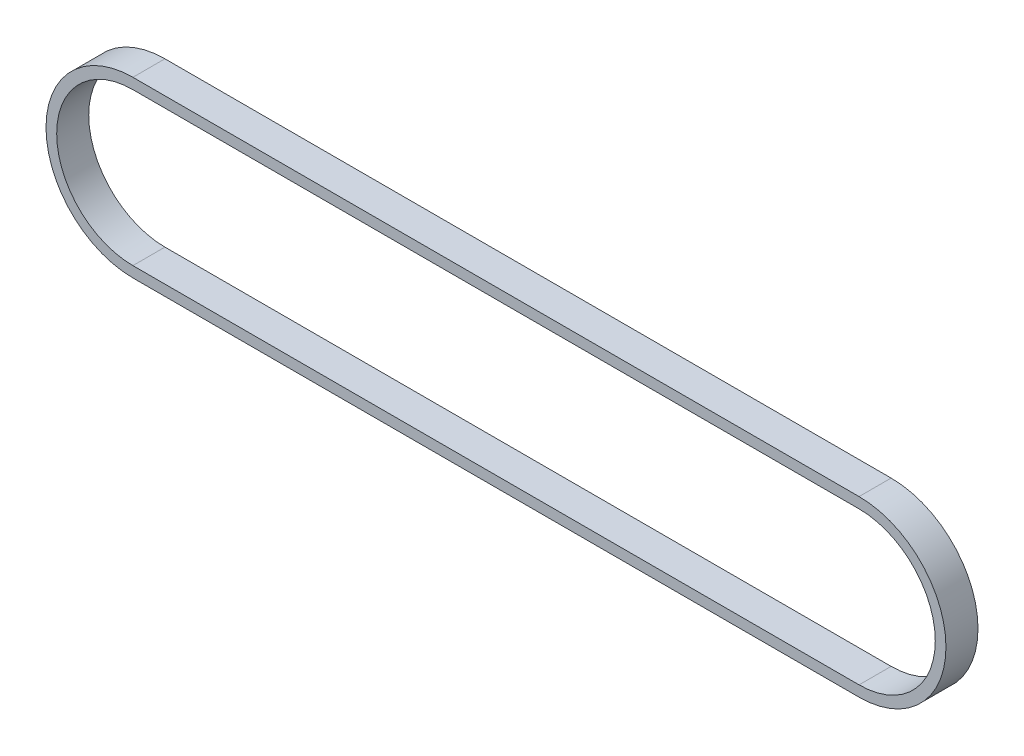
ISO-10303-21;
HEADER;
FILE_DESCRIPTION(('STEP AP214'),'2;1');
FILE_NAME('part.step','',(''),(''),'','','');
FILE_SCHEMA(('AUTOMOTIVE_DESIGN { 1 0 10303 214 1 1 1 1 }'));
ENDSEC;
DATA;
#1=APPLICATION_CONTEXT('core data for automotive mechanical design processes');
#2=APPLICATION_PROTOCOL_DEFINITION('international standard','automotive_design',2000,#1);
#3=PRODUCT_CONTEXT('',#1,'mechanical');
#4=PRODUCT('Part','Part','',(#3));
#5=PRODUCT_RELATED_PRODUCT_CATEGORY('part','',(#4));
#6=PRODUCT_DEFINITION_FORMATION('','',#4);
#7=PRODUCT_DEFINITION_CONTEXT('part definition',#1,'design');
#8=PRODUCT_DEFINITION('design','',#6,#7);
#9=PRODUCT_DEFINITION_SHAPE('','',#8);
#10=(LENGTH_UNIT() NAMED_UNIT(*) SI_UNIT(.MILLI.,.METRE.));
#11=(NAMED_UNIT(*) PLANE_ANGLE_UNIT() SI_UNIT($,.RADIAN.));
#12=(NAMED_UNIT(*) SI_UNIT($,.STERADIAN.) SOLID_ANGLE_UNIT());
#13=UNCERTAINTY_MEASURE_WITH_UNIT(LENGTH_MEASURE(1.E-05),#10,'distance_accuracy_value','');
#14=(GEOMETRIC_REPRESENTATION_CONTEXT(3) GLOBAL_UNCERTAINTY_ASSIGNED_CONTEXT((#13)) GLOBAL_UNIT_ASSIGNED_CONTEXT((#10,
#11,#12)) REPRESENTATION_CONTEXT('',''));
#15=CARTESIAN_POINT('',(0.,0.,0.));
#16=DIRECTION('',(0.,0.,1.));
#17=DIRECTION('',(1.,0.,0.));
#18=AXIS2_PLACEMENT_3D('',#15,#16,#17);
#19=CARTESIAN_POINT('',(0.,0.,4.5));
#20=DIRECTION('',(0.,0.,-1.));
#21=DIRECTION('',(-1.,0.,0.));
#22=AXIS2_PLACEMENT_3D('',#19,#20,#21);
#23=CYLINDRICAL_SURFACE('',#22,21.4);
#24=CARTESIAN_POINT('',(0.,0.,-4.5));
#25=DIRECTION('',(0.,0.,1.));
#26=DIRECTION('',(1.,0.,0.));
#27=AXIS2_PLACEMENT_3D('',#24,#25,#26);
#28=CIRCLE('',#27,21.4);
#29=CARTESIAN_POINT('',(0.,21.4,-4.5));
#30=VERTEX_POINT('',#29);
#31=CARTESIAN_POINT('',(0.,-21.4,-4.5));
#32=VERTEX_POINT('',#31);
#33=EDGE_CURVE('E146',#30,#32,#28,.T.);
#34=ORIENTED_EDGE('',*,*,#33,.F.);
#35=DIRECTION('',(0.,0.,-1.));
#36=VECTOR('',#35,1.);
#37=CARTESIAN_POINT('',(0.,21.4,4.5));
#38=LINE('',#37,#36);
#39=CARTESIAN_POINT('',(0.,21.4,4.5));
#40=VERTEX_POINT('',#39);
#41=EDGE_CURVE('E11',#40,#30,#38,.T.);
#42=ORIENTED_EDGE('',*,*,#41,.F.);
#43=CARTESIAN_POINT('',(0.,0.,4.5));
#44=DIRECTION('',(0.,0.,1.));
#45=DIRECTION('',(1.,0.,0.));
#46=AXIS2_PLACEMENT_3D('',#43,#44,#45);
#47=CIRCLE('',#46,21.4);
#48=CARTESIAN_POINT('',(0.,-21.4,4.5));
#49=VERTEX_POINT('',#48);
#50=EDGE_CURVE('E118',#40,#49,#47,.T.);
#51=ORIENTED_EDGE('',*,*,#50,.T.);
#52=DIRECTION('',(0.,0.,-1.));
#53=VECTOR('',#52,1.);
#54=CARTESIAN_POINT('',(0.,-21.4,4.5));
#55=LINE('',#54,#53);
#56=EDGE_CURVE('E57',#49,#32,#55,.T.);
#57=ORIENTED_EDGE('',*,*,#56,.T.);
#58=EDGE_LOOP('',(#34,#42,#51,#57));
#59=FACE_BOUND('',#58,.T.);
#60=ADVANCED_FACE('F38',(#59),#23,.F.);
#61=CARTESIAN_POINT('',(0.,21.4,4.5));
#62=DIRECTION('',(0.,1.,0.));
#63=DIRECTION('',(0.,0.,1.));
#64=AXIS2_PLACEMENT_3D('',#61,#62,#63);
#65=PLANE('',#64);
#66=DIRECTION('',(1.,0.,0.));
#67=VECTOR('',#66,1.);
#68=CARTESIAN_POINT('',(0.,21.4,-4.5));
#69=LINE('',#68,#67);
#70=CARTESIAN_POINT('',(203.94484,21.4,-4.5));
#71=VERTEX_POINT('',#70);
#72=EDGE_CURVE('E124',#30,#71,#69,.T.);
#73=ORIENTED_EDGE('',*,*,#72,.T.);
#74=DIRECTION('',(0.,0.,-1.));
#75=VECTOR('',#74,1.);
#76=CARTESIAN_POINT('',(203.94484,21.4,4.5));
#77=LINE('',#76,#75);
#78=CARTESIAN_POINT('',(203.94484,21.4,4.5));
#79=VERTEX_POINT('',#78);
#80=EDGE_CURVE('E48',#79,#71,#77,.T.);
#81=ORIENTED_EDGE('',*,*,#80,.F.);
#82=DIRECTION('',(1.,0.,0.));
#83=VECTOR('',#82,1.);
#84=CARTESIAN_POINT('',(0.,21.4,4.5));
#85=LINE('',#84,#83);
#86=EDGE_CURVE('E112',#40,#79,#85,.T.);
#87=ORIENTED_EDGE('',*,*,#86,.F.);
#88=ORIENTED_EDGE('',*,*,#41,.T.);
#89=EDGE_LOOP('',(#73,#81,#87,#88));
#90=FACE_BOUND('',#89,.T.);
#91=ADVANCED_FACE('F122',(#90),#65,.F.);
#92=CARTESIAN_POINT('',(203.94484,0.,4.5));
#93=DIRECTION('',(0.,0.,-1.));
#94=DIRECTION('',(-1.,0.,0.));
#95=AXIS2_PLACEMENT_3D('',#92,#93,#94);
#96=CYLINDRICAL_SURFACE('',#95,21.4);
#97=CARTESIAN_POINT('',(203.94484,0.,-4.5));
#98=DIRECTION('',(0.,0.,1.));
#99=DIRECTION('',(1.,0.,0.));
#100=AXIS2_PLACEMENT_3D('',#97,#98,#99);
#101=CIRCLE('',#100,21.4);
#102=CARTESIAN_POINT('',(203.94484,-21.4,-4.5));
#103=VERTEX_POINT('',#102);
#104=EDGE_CURVE('E149',#103,#71,#101,.T.);
#105=ORIENTED_EDGE('',*,*,#104,.F.);
#106=DIRECTION('',(0.,0.,-1.));
#107=VECTOR('',#106,1.);
#108=CARTESIAN_POINT('',(203.94484,-21.4,4.5));
#109=LINE('',#108,#107);
#110=CARTESIAN_POINT('',(203.94484,-21.4,4.5));
#111=VERTEX_POINT('',#110);
#112=EDGE_CURVE('E82',#111,#103,#109,.T.);
#113=ORIENTED_EDGE('',*,*,#112,.F.);
#114=CARTESIAN_POINT('',(203.94484,0.,4.5));
#115=DIRECTION('',(0.,0.,1.));
#116=DIRECTION('',(1.,0.,0.));
#117=AXIS2_PLACEMENT_3D('',#114,#115,#116);
#118=CIRCLE('',#117,21.4);
#119=EDGE_CURVE('E117',#111,#79,#118,.T.);
#120=ORIENTED_EDGE('',*,*,#119,.T.);
#121=ORIENTED_EDGE('',*,*,#80,.T.);
#122=EDGE_LOOP('',(#105,#113,#120,#121));
#123=FACE_BOUND('',#122,.T.);
#124=ADVANCED_FACE('F128',(#123),#96,.F.);
#125=CARTESIAN_POINT('',(0.,-24.4,4.5));
#126=DIRECTION('',(0.,1.,0.));
#127=DIRECTION('',(0.,0.,1.));
#128=AXIS2_PLACEMENT_3D('',#125,#126,#127);
#129=PLANE('',#128);
#130=DIRECTION('',(1.,0.,0.));
#131=VECTOR('',#130,1.);
#132=CARTESIAN_POINT('',(0.,-24.4,-4.5));
#133=LINE('',#132,#131);
#134=CARTESIAN_POINT('',(0.,-24.4,-4.5));
#135=VERTEX_POINT('',#134);
#136=CARTESIAN_POINT('',(203.94484,-24.4,-4.5));
#137=VERTEX_POINT('',#136);
#138=EDGE_CURVE('E135',#135,#137,#133,.T.);
#139=ORIENTED_EDGE('',*,*,#138,.T.);
#140=DIRECTION('',(0.,0.,-1.));
#141=VECTOR('',#140,1.);
#142=CARTESIAN_POINT('',(203.94484,-24.4,4.5));
#143=LINE('',#142,#141);
#144=CARTESIAN_POINT('',(203.94484,-24.4,4.5));
#145=VERTEX_POINT('',#144);
#146=EDGE_CURVE('E42',#145,#137,#143,.T.);
#147=ORIENTED_EDGE('',*,*,#146,.F.);
#148=DIRECTION('',(1.,0.,0.));
#149=VECTOR('',#148,1.);
#150=CARTESIAN_POINT('',(0.,-24.4,4.5));
#151=LINE('',#150,#149);
#152=CARTESIAN_POINT('',(0.,-24.4,4.5));
#153=VERTEX_POINT('',#152);
#154=EDGE_CURVE('E154',#153,#145,#151,.T.);
#155=ORIENTED_EDGE('',*,*,#154,.F.);
#156=DIRECTION('',(0.,0.,-1.));
#157=VECTOR('',#156,1.);
#158=CARTESIAN_POINT('',(0.,-24.4,4.5));
#159=LINE('',#158,#157);
#160=EDGE_CURVE('E131',#153,#135,#159,.T.);
#161=ORIENTED_EDGE('',*,*,#160,.T.);
#162=EDGE_LOOP('',(#139,#147,#155,#161));
#163=FACE_BOUND('',#162,.T.);
#164=ADVANCED_FACE('F40',(#163),#129,.F.);
#165=CARTESIAN_POINT('',(203.94484,0.,4.5));
#166=DIRECTION('',(0.,0.,-1.));
#167=DIRECTION('',(-1.,0.,0.));
#168=AXIS2_PLACEMENT_3D('',#165,#166,#167);
#169=CYLINDRICAL_SURFACE('',#168,24.4);
#170=CARTESIAN_POINT('',(203.94484,0.,-4.5));
#171=DIRECTION('',(0.,0.,1.));
#172=DIRECTION('',(1.,0.,0.));
#173=AXIS2_PLACEMENT_3D('',#170,#171,#172);
#174=CIRCLE('',#173,24.4);
#175=CARTESIAN_POINT('',(203.94484,24.4,-4.5));
#176=VERTEX_POINT('',#175);
#177=EDGE_CURVE('E138',#137,#176,#174,.T.);
#178=ORIENTED_EDGE('',*,*,#177,.T.);
#179=DIRECTION('',(0.,0.,-1.));
#180=VECTOR('',#179,1.);
#181=CARTESIAN_POINT('',(203.94484,24.4,4.5));
#182=LINE('',#181,#180);
#183=CARTESIAN_POINT('',(203.94484,24.4,4.5));
#184=VERTEX_POINT('',#183);
#185=EDGE_CURVE('E160',#184,#176,#182,.T.);
#186=ORIENTED_EDGE('',*,*,#185,.F.);
#187=CARTESIAN_POINT('',(203.94484,0.,4.5));
#188=DIRECTION('',(0.,0.,1.));
#189=DIRECTION('',(1.,0.,0.));
#190=AXIS2_PLACEMENT_3D('',#187,#188,#189);
#191=CIRCLE('',#190,24.4);
#192=EDGE_CURVE('E95',#145,#184,#191,.T.);
#193=ORIENTED_EDGE('',*,*,#192,.F.);
#194=ORIENTED_EDGE('',*,*,#146,.T.);
#195=EDGE_LOOP('',(#178,#186,#193,#194));
#196=FACE_BOUND('',#195,.T.);
#197=ADVANCED_FACE('F165',(#196),#169,.T.);
#198=CARTESIAN_POINT('',(0.,24.4,4.5));
#199=DIRECTION('',(0.,1.,0.));
#200=DIRECTION('',(0.,0.,1.));
#201=AXIS2_PLACEMENT_3D('',#198,#199,#200);
#202=PLANE('',#201);
#203=DIRECTION('',(1.,0.,0.));
#204=VECTOR('',#203,1.);
#205=CARTESIAN_POINT('',(0.,24.4,-4.5));
#206=LINE('',#205,#204);
#207=CARTESIAN_POINT('',(0.,24.4,-4.5));
#208=VERTEX_POINT('',#207);
#209=EDGE_CURVE('E141',#208,#176,#206,.T.);
#210=ORIENTED_EDGE('',*,*,#209,.F.);
#211=DIRECTION('',(0.,0.,-1.));
#212=VECTOR('',#211,1.);
#213=CARTESIAN_POINT('',(0.,24.4,4.5));
#214=LINE('',#213,#212);
#215=CARTESIAN_POINT('',(0.,24.4,4.5));
#216=VERTEX_POINT('',#215);
#217=EDGE_CURVE('E159',#216,#208,#214,.T.);
#218=ORIENTED_EDGE('',*,*,#217,.F.);
#219=DIRECTION('',(1.,0.,0.));
#220=VECTOR('',#219,1.);
#221=CARTESIAN_POINT('',(0.,24.4,4.5));
#222=LINE('',#221,#220);
#223=EDGE_CURVE('E177',#216,#184,#222,.T.);
#224=ORIENTED_EDGE('',*,*,#223,.T.);
#225=ORIENTED_EDGE('',*,*,#185,.T.);
#226=EDGE_LOOP('',(#210,#218,#224,#225));
#227=FACE_BOUND('',#226,.T.);
#228=ADVANCED_FACE('F174',(#227),#202,.T.);
#229=CARTESIAN_POINT('',(0.,0.,4.5));
#230=DIRECTION('',(0.,0.,-1.));
#231=DIRECTION('',(-1.,0.,0.));
#232=AXIS2_PLACEMENT_3D('',#229,#230,#231);
#233=CYLINDRICAL_SURFACE('',#232,24.4);
#234=CARTESIAN_POINT('',(0.,0.,-4.5));
#235=DIRECTION('',(0.,0.,1.));
#236=DIRECTION('',(1.,0.,0.));
#237=AXIS2_PLACEMENT_3D('',#234,#235,#236);
#238=CIRCLE('',#237,24.4);
#239=EDGE_CURVE('E144',#208,#135,#238,.T.);
#240=ORIENTED_EDGE('',*,*,#239,.T.);
#241=ORIENTED_EDGE('',*,*,#160,.F.);
#242=CARTESIAN_POINT('',(0.,0.,4.5));
#243=DIRECTION('',(0.,0.,1.));
#244=DIRECTION('',(1.,0.,0.));
#245=AXIS2_PLACEMENT_3D('',#242,#243,#244);
#246=CIRCLE('',#245,24.4);
#247=EDGE_CURVE('E179',#216,#153,#246,.T.);
#248=ORIENTED_EDGE('',*,*,#247,.F.);
#249=ORIENTED_EDGE('',*,*,#217,.T.);
#250=EDGE_LOOP('',(#240,#241,#248,#249));
#251=FACE_BOUND('',#250,.T.);
#252=ADVANCED_FACE('F180',(#251),#233,.T.);
#253=CARTESIAN_POINT('',(0.,-21.4,4.5));
#254=DIRECTION('',(0.,1.,0.));
#255=DIRECTION('',(0.,0.,1.));
#256=AXIS2_PLACEMENT_3D('',#253,#254,#255);
#257=PLANE('',#256);
#258=DIRECTION('',(1.,0.,0.));
#259=VECTOR('',#258,1.);
#260=CARTESIAN_POINT('',(0.,-21.4,-4.5));
#261=LINE('',#260,#259);
#262=EDGE_CURVE('E151',#32,#103,#261,.T.);
#263=ORIENTED_EDGE('',*,*,#262,.F.);
#264=ORIENTED_EDGE('',*,*,#56,.F.);
#265=DIRECTION('',(1.,0.,0.));
#266=VECTOR('',#265,1.);
#267=CARTESIAN_POINT('',(0.,-21.4,4.5));
#268=LINE('',#267,#266);
#269=EDGE_CURVE('E129',#49,#111,#268,.T.);
#270=ORIENTED_EDGE('',*,*,#269,.T.);
#271=ORIENTED_EDGE('',*,*,#112,.T.);
#272=EDGE_LOOP('',(#263,#264,#270,#271));
#273=FACE_BOUND('',#272,.T.);
#274=ADVANCED_FACE('F186',(#273),#257,.T.);
#275=CARTESIAN_POINT('',(0.,0.,4.5));
#276=DIRECTION('',(0.,0.,1.));
#277=DIRECTION('',(1.,0.,0.));
#278=AXIS2_PLACEMENT_3D('',#275,#276,#277);
#279=PLANE('',#278);
#280=ORIENTED_EDGE('',*,*,#154,.T.);
#281=ORIENTED_EDGE('',*,*,#192,.T.);
#282=ORIENTED_EDGE('',*,*,#223,.F.);
#283=ORIENTED_EDGE('',*,*,#247,.T.);
#284=EDGE_LOOP('',(#280,#281,#282,#283));
#285=FACE_BOUND('',#284,.T.);
#286=ORIENTED_EDGE('',*,*,#50,.F.);
#287=ORIENTED_EDGE('',*,*,#86,.T.);
#288=ORIENTED_EDGE('',*,*,#119,.F.);
#289=ORIENTED_EDGE('',*,*,#269,.F.);
#290=EDGE_LOOP('',(#286,#287,#288,#289));
#291=FACE_BOUND('',#290,.T.);
#292=ADVANCED_FACE('F114',(#285,#291),#279,.T.);
#293=CARTESIAN_POINT('',(0.,0.,-4.5));
#294=DIRECTION('',(0.,0.,1.));
#295=DIRECTION('',(1.,0.,0.));
#296=AXIS2_PLACEMENT_3D('',#293,#294,#295);
#297=PLANE('',#296);
#298=ORIENTED_EDGE('',*,*,#138,.F.);
#299=ORIENTED_EDGE('',*,*,#239,.F.);
#300=ORIENTED_EDGE('',*,*,#209,.T.);
#301=ORIENTED_EDGE('',*,*,#177,.F.);
#302=EDGE_LOOP('',(#298,#299,#300,#301));
#303=FACE_BOUND('',#302,.T.);
#304=ORIENTED_EDGE('',*,*,#33,.T.);
#305=ORIENTED_EDGE('',*,*,#262,.T.);
#306=ORIENTED_EDGE('',*,*,#104,.T.);
#307=ORIENTED_EDGE('',*,*,#72,.F.);
#308=EDGE_LOOP('',(#304,#305,#306,#307));
#309=FACE_BOUND('',#308,.T.);
#310=ADVANCED_FACE('F172',(#303,#309),#297,.F.);
#311=CLOSED_SHELL('',(#60,#91,#124,#164,#197,#228,#252,#274,#292,#310));
#312=MANIFOLD_SOLID_BREP('B2',#311);
#313=ADVANCED_BREP_SHAPE_REPRESENTATION('',(#18,#312),#14);
#314=SHAPE_DEFINITION_REPRESENTATION(#9,#313);
ENDSEC;
END-ISO-10303-21;
